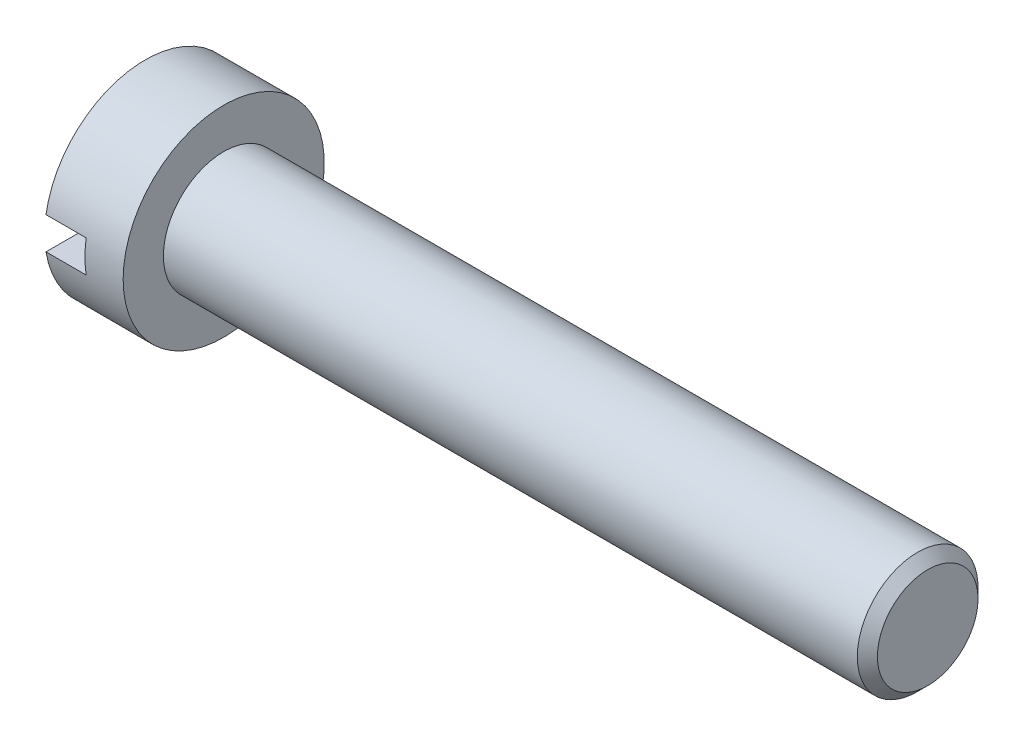
ISO-10303-21;
HEADER;
FILE_DESCRIPTION(('STEP AP214'),'2;1');
FILE_NAME('part.step','',(''),(''),'','','');
FILE_SCHEMA(('AUTOMOTIVE_DESIGN { 1 0 10303 214 1 1 1 1 }'));
ENDSEC;
DATA;
#1=APPLICATION_CONTEXT('core data for automotive mechanical design processes');
#2=APPLICATION_PROTOCOL_DEFINITION('international standard','automotive_design',2000,#1);
#3=PRODUCT_CONTEXT('',#1,'mechanical');
#4=PRODUCT('Part','Part','',(#3));
#5=PRODUCT_RELATED_PRODUCT_CATEGORY('part','',(#4));
#6=PRODUCT_DEFINITION_FORMATION('','',#4);
#7=PRODUCT_DEFINITION_CONTEXT('part definition',#1,'design');
#8=PRODUCT_DEFINITION('design','',#6,#7);
#9=PRODUCT_DEFINITION_SHAPE('','',#8);
#10=(LENGTH_UNIT() NAMED_UNIT(*) SI_UNIT(.MILLI.,.METRE.));
#11=(NAMED_UNIT(*) PLANE_ANGLE_UNIT() SI_UNIT($,.RADIAN.));
#12=(NAMED_UNIT(*) SI_UNIT($,.STERADIAN.) SOLID_ANGLE_UNIT());
#13=UNCERTAINTY_MEASURE_WITH_UNIT(LENGTH_MEASURE(1.E-05),#10,'distance_accuracy_value','');
#14=(GEOMETRIC_REPRESENTATION_CONTEXT(3) GLOBAL_UNCERTAINTY_ASSIGNED_CONTEXT((#13)) GLOBAL_UNIT_ASSIGNED_CONTEXT((#10,
#11,#12)) REPRESENTATION_CONTEXT('',''));
#15=CARTESIAN_POINT('',(0.,0.,0.));
#16=DIRECTION('',(0.,0.,1.));
#17=DIRECTION('',(1.,0.,0.));
#18=AXIS2_PLACEMENT_3D('',#15,#16,#17);
#19=CARTESIAN_POINT('',(-3.9,5.,0.));
#20=DIRECTION('',(1.,0.,0.));
#21=DIRECTION('',(0.,0.,-1.));
#22=AXIS2_PLACEMENT_3D('',#19,#20,#21);
#23=PLANE('',#22);
#24=CARTESIAN_POINT('',(-3.9,0.,0.));
#25=DIRECTION('',(-1.,0.,0.));
#26=DIRECTION('',(0.,0.,1.));
#27=AXIS2_PLACEMENT_3D('',#24,#25,#26);
#28=CIRCLE('',#27,5.);
#29=CARTESIAN_POINT('',(-3.9,0.8,4.93558507170123));
#30=VERTEX_POINT('',#29);
#31=CARTESIAN_POINT('',(-3.9,0.8,-4.93558507170123));
#32=VERTEX_POINT('',#31);
#33=EDGE_CURVE('E94',#30,#32,#28,.T.);
#34=ORIENTED_EDGE('',*,*,#33,.T.);
#35=DIRECTION('',(0.,0.,-1.));
#36=VECTOR('',#35,1.);
#37=CARTESIAN_POINT('',(-3.9,0.8,-6.));
#38=LINE('',#37,#36);
#39=EDGE_CURVE('E88',#30,#32,#38,.T.);
#40=ORIENTED_EDGE('',*,*,#39,.F.);
#41=EDGE_LOOP('',(#34,#40));
#42=FACE_BOUND('',#41,.T.);
#43=ADVANCED_FACE('F39',(#42),#23,.F.);
#44=CARTESIAN_POINT('',(-3.9,0.,0.));
#45=DIRECTION('',(-1.,0.,0.));
#46=DIRECTION('',(0.,0.,1.));
#47=AXIS2_PLACEMENT_3D('',#44,#45,#46);
#48=CYLINDRICAL_SURFACE('',#47,3.);
#49=CARTESIAN_POINT('',(0.,0.,0.));
#50=DIRECTION('',(-1.,0.,0.));
#51=DIRECTION('',(0.,0.,1.));
#52=AXIS2_PLACEMENT_3D('',#49,#50,#51);
#53=CIRCLE('',#52,3.);
#54=CARTESIAN_POINT('',(0.,0.,3.));
#55=VERTEX_POINT('',#54);
#56=EDGE_CURVE('E100',#55,#55,#53,.T.);
#57=ORIENTED_EDGE('',*,*,#56,.F.);
#58=EDGE_LOOP('',(#57));
#59=FACE_BOUND('',#58,.T.);
#60=CARTESIAN_POINT('',(34.5,0.,0.));
#61=DIRECTION('',(-1.,0.,0.));
#62=DIRECTION('',(0.,0.,1.));
#63=AXIS2_PLACEMENT_3D('',#60,#61,#62);
#64=CIRCLE('',#63,3.);
#65=CARTESIAN_POINT('',(34.5,0.,3.));
#66=VERTEX_POINT('',#65);
#67=EDGE_CURVE('E106',#66,#66,#64,.T.);
#68=ORIENTED_EDGE('',*,*,#67,.T.);
#69=EDGE_LOOP('',(#68));
#70=FACE_BOUND('',#69,.T.);
#71=ADVANCED_FACE('F41',(#59,#70),#48,.T.);
#72=CARTESIAN_POINT('',(35.,0.,0.));
#73=DIRECTION('',(-1.,0.,0.));
#74=DIRECTION('',(0.,0.,1.));
#75=AXIS2_PLACEMENT_3D('',#72,#73,#74);
#76=CONICAL_SURFACE('',#75,2.5,0.785398163397448);
#77=ORIENTED_EDGE('',*,*,#67,.F.);
#78=EDGE_LOOP('',(#77));
#79=FACE_BOUND('',#78,.T.);
#80=CARTESIAN_POINT('',(35.,0.,0.));
#81=DIRECTION('',(-1.,0.,0.));
#82=DIRECTION('',(0.,0.,1.));
#83=AXIS2_PLACEMENT_3D('',#80,#81,#82);
#84=CIRCLE('',#83,2.5);
#85=CARTESIAN_POINT('',(35.,0.,2.5));
#86=VERTEX_POINT('',#85);
#87=EDGE_CURVE('E98',#86,#86,#84,.T.);
#88=ORIENTED_EDGE('',*,*,#87,.T.);
#89=EDGE_LOOP('',(#88));
#90=FACE_BOUND('',#89,.T.);
#91=ADVANCED_FACE('F140',(#79,#90),#76,.T.);
#92=CARTESIAN_POINT('',(35.,0.,0.));
#93=DIRECTION('',(-1.,0.,0.));
#94=DIRECTION('',(0.,0.,1.));
#95=AXIS2_PLACEMENT_3D('',#92,#93,#94);
#96=PLANE('',#95);
#97=ORIENTED_EDGE('',*,*,#87,.F.);
#98=EDGE_LOOP('',(#97));
#99=FACE_BOUND('',#98,.T.);
#100=ADVANCED_FACE('F145',(#99),#96,.F.);
#101=CARTESIAN_POINT('',(-3.9,-0.8,-4.93558507170123));
#102=VERTEX_POINT('',#101);
#103=CARTESIAN_POINT('',(-3.9,-0.8,4.93558507170123));
#104=VERTEX_POINT('',#103);
#105=EDGE_CURVE('E87',#102,#104,#28,.T.);
#106=ORIENTED_EDGE('',*,*,#105,.T.);
#107=DIRECTION('',(0.,0.,1.));
#108=VECTOR('',#107,1.);
#109=CARTESIAN_POINT('',(-3.9,-0.8,-6.));
#110=LINE('',#109,#108);
#111=EDGE_CURVE('E80',#102,#104,#110,.T.);
#112=ORIENTED_EDGE('',*,*,#111,.F.);
#113=EDGE_LOOP('',(#106,#112));
#114=FACE_BOUND('',#113,.T.);
#115=ADVANCED_FACE('F86',(#114),#23,.F.);
#116=CARTESIAN_POINT('',(-3.9,0.,0.));
#117=DIRECTION('',(-1.,0.,0.));
#118=DIRECTION('',(0.,0.,1.));
#119=AXIS2_PLACEMENT_3D('',#116,#117,#118);
#120=CYLINDRICAL_SURFACE('',#119,5.);
#121=CARTESIAN_POINT('',(-1.9,0.,0.));
#122=DIRECTION('',(-1.,0.,0.));
#123=DIRECTION('',(0.,0.,1.));
#124=AXIS2_PLACEMENT_3D('',#121,#122,#123);
#125=CIRCLE('',#124,5.);
#126=CARTESIAN_POINT('',(-1.9,0.8,-4.93558507170123));
#127=VERTEX_POINT('',#126);
#128=CARTESIAN_POINT('',(-1.9,-0.8,-4.93558507170123));
#129=VERTEX_POINT('',#128);
#130=EDGE_CURVE('E59',#127,#129,#125,.T.);
#131=ORIENTED_EDGE('',*,*,#130,.F.);
#132=DIRECTION('',(-1.,0.,0.));
#133=VECTOR('',#132,1.);
#134=CARTESIAN_POINT('',(-3.9,0.8,-4.93558507170123));
#135=LINE('',#134,#133);
#136=EDGE_CURVE('E11',#127,#32,#135,.T.);
#137=ORIENTED_EDGE('',*,*,#136,.T.);
#138=ORIENTED_EDGE('',*,*,#33,.F.);
#139=DIRECTION('',(-1.,0.,0.));
#140=VECTOR('',#139,1.);
#141=CARTESIAN_POINT('',(-3.9,0.8,4.93558507170123));
#142=LINE('',#141,#140);
#143=CARTESIAN_POINT('',(-1.9,0.8,4.93558507170123));
#144=VERTEX_POINT('',#143);
#145=EDGE_CURVE('E112',#30,#144,#142,.F.);
#146=ORIENTED_EDGE('',*,*,#145,.T.);
#147=CARTESIAN_POINT('',(-1.9,-0.8,4.93558507170123));
#148=VERTEX_POINT('',#147);
#149=EDGE_CURVE('E109',#148,#144,#125,.T.);
#150=ORIENTED_EDGE('',*,*,#149,.F.);
#151=DIRECTION('',(-1.,0.,0.));
#152=VECTOR('',#151,1.);
#153=CARTESIAN_POINT('',(-3.9,-0.8,4.93558507170123));
#154=LINE('',#153,#152);
#155=EDGE_CURVE('E93',#148,#104,#154,.T.);
#156=ORIENTED_EDGE('',*,*,#155,.T.);
#157=ORIENTED_EDGE('',*,*,#105,.F.);
#158=DIRECTION('',(-1.,0.,0.));
#159=VECTOR('',#158,1.);
#160=CARTESIAN_POINT('',(-3.9,-0.8,-4.93558507170123));
#161=LINE('',#160,#159);
#162=EDGE_CURVE('E47',#102,#129,#161,.F.);
#163=ORIENTED_EDGE('',*,*,#162,.T.);
#164=EDGE_LOOP('',(#131,#137,#138,#146,#150,#156,#157,#163));
#165=FACE_BOUND('',#164,.T.);
#166=CARTESIAN_POINT('',(0.,0.,0.));
#167=DIRECTION('',(-1.,0.,0.));
#168=DIRECTION('',(0.,0.,1.));
#169=AXIS2_PLACEMENT_3D('',#166,#167,#168);
#170=CIRCLE('',#169,5.);
#171=CARTESIAN_POINT('',(0.,0.,5.));
#172=VERTEX_POINT('',#171);
#173=EDGE_CURVE('E95',#172,#172,#170,.T.);
#174=ORIENTED_EDGE('',*,*,#173,.T.);
#175=EDGE_LOOP('',(#174));
#176=FACE_BOUND('',#175,.T.);
#177=ADVANCED_FACE('F90',(#165,#176),#120,.T.);
#178=CARTESIAN_POINT('',(0.,3.,0.));
#179=DIRECTION('',(-1.,0.,0.));
#180=DIRECTION('',(0.,0.,1.));
#181=AXIS2_PLACEMENT_3D('',#178,#179,#180);
#182=PLANE('',#181);
#183=ORIENTED_EDGE('',*,*,#173,.F.);
#184=EDGE_LOOP('',(#183));
#185=FACE_BOUND('',#184,.T.);
#186=ORIENTED_EDGE('',*,*,#56,.T.);
#187=EDGE_LOOP('',(#186));
#188=FACE_BOUND('',#187,.T.);
#189=ADVANCED_FACE('F150',(#185,#188),#182,.F.);
#190=CARTESIAN_POINT('',(-1.9,0.8,-6.));
#191=DIRECTION('',(0.,1.,0.));
#192=DIRECTION('',(0.,0.,1.));
#193=AXIS2_PLACEMENT_3D('',#190,#191,#192);
#194=PLANE('',#193);
#195=DIRECTION('',(0.,0.,-1.));
#196=VECTOR('',#195,1.);
#197=CARTESIAN_POINT('',(-1.9,0.8,-6.));
#198=LINE('',#197,#196);
#199=EDGE_CURVE('E119',#144,#127,#198,.T.);
#200=ORIENTED_EDGE('',*,*,#199,.F.);
#201=ORIENTED_EDGE('',*,*,#145,.F.);
#202=ORIENTED_EDGE('',*,*,#39,.T.);
#203=ORIENTED_EDGE('',*,*,#136,.F.);
#204=EDGE_LOOP('',(#200,#201,#202,#203));
#205=FACE_BOUND('',#204,.T.);
#206=ADVANCED_FACE('F118',(#205),#194,.F.);
#207=CARTESIAN_POINT('',(-1.9,-0.8,-6.));
#208=DIRECTION('',(0.,-1.,0.));
#209=DIRECTION('',(0.,0.,-1.));
#210=AXIS2_PLACEMENT_3D('',#207,#208,#209);
#211=PLANE('',#210);
#212=DIRECTION('',(0.,0.,1.));
#213=VECTOR('',#212,1.);
#214=CARTESIAN_POINT('',(-1.9,-0.8,-6.));
#215=LINE('',#214,#213);
#216=EDGE_CURVE('E54',#129,#148,#215,.T.);
#217=ORIENTED_EDGE('',*,*,#216,.F.);
#218=ORIENTED_EDGE('',*,*,#162,.F.);
#219=ORIENTED_EDGE('',*,*,#111,.T.);
#220=ORIENTED_EDGE('',*,*,#155,.F.);
#221=EDGE_LOOP('',(#217,#218,#219,#220));
#222=FACE_BOUND('',#221,.T.);
#223=ADVANCED_FACE('F79',(#222),#211,.F.);
#224=CARTESIAN_POINT('',(-1.9,0.,0.));
#225=DIRECTION('',(-1.,0.,0.));
#226=DIRECTION('',(0.,0.,1.));
#227=AXIS2_PLACEMENT_3D('',#224,#225,#226);
#228=PLANE('',#227);
#229=ORIENTED_EDGE('',*,*,#130,.T.);
#230=ORIENTED_EDGE('',*,*,#216,.T.);
#231=ORIENTED_EDGE('',*,*,#149,.T.);
#232=ORIENTED_EDGE('',*,*,#199,.T.);
#233=EDGE_LOOP('',(#229,#230,#231,#232));
#234=FACE_BOUND('',#233,.T.);
#235=ADVANCED_FACE('F127',(#234),#228,.T.);
#236=CLOSED_SHELL('',(#43,#71,#91,#100,#115,#177,#189,#206,#223,#235));
#237=MANIFOLD_SOLID_BREP('B2',#236);
#238=ADVANCED_BREP_SHAPE_REPRESENTATION('',(#18,#237),#14);
#239=SHAPE_DEFINITION_REPRESENTATION(#9,#238);
ENDSEC;
END-ISO-10303-21;
